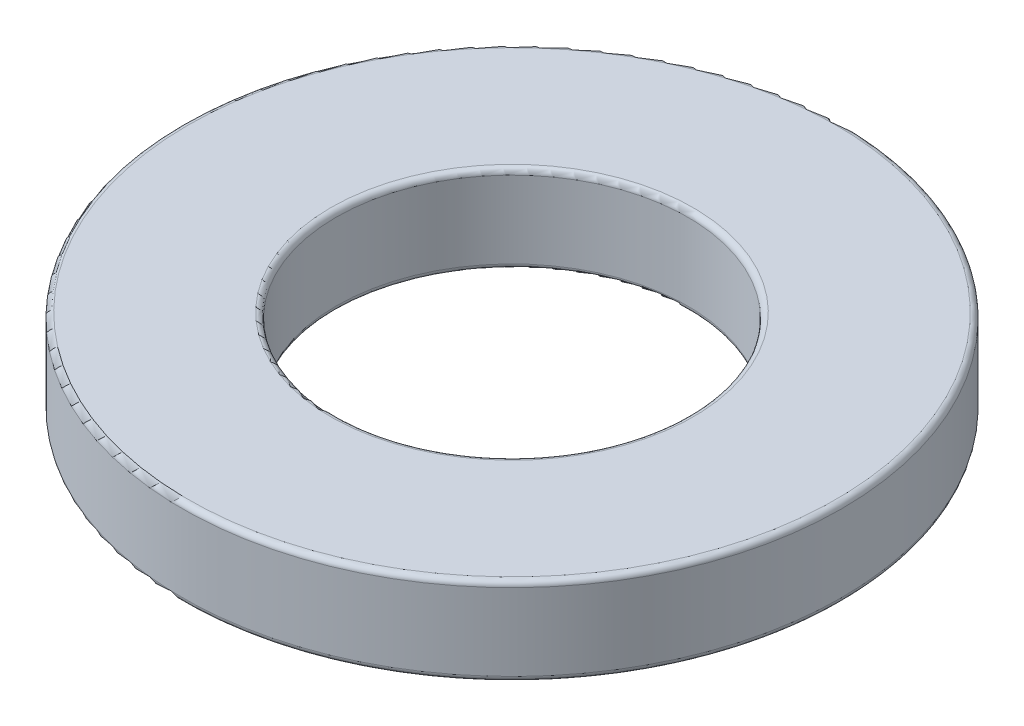
ISO-10303-21;
HEADER;
FILE_DESCRIPTION(('STEP AP214'),'2;1');
FILE_NAME('part.step','',(''),(''),'','','');
FILE_SCHEMA(('AUTOMOTIVE_DESIGN { 1 0 10303 214 1 1 1 1 }'));
ENDSEC;
DATA;
#1=APPLICATION_CONTEXT('core data for automotive mechanical design processes');
#2=APPLICATION_PROTOCOL_DEFINITION('international standard','automotive_design',2000,#1);
#3=PRODUCT_CONTEXT('',#1,'mechanical');
#4=PRODUCT('Part','Part','',(#3));
#5=PRODUCT_RELATED_PRODUCT_CATEGORY('part','',(#4));
#6=PRODUCT_DEFINITION_FORMATION('','',#4);
#7=PRODUCT_DEFINITION_CONTEXT('part definition',#1,'design');
#8=PRODUCT_DEFINITION('design','',#6,#7);
#9=PRODUCT_DEFINITION_SHAPE('','',#8);
#10=(LENGTH_UNIT() NAMED_UNIT(*) SI_UNIT(.MILLI.,.METRE.));
#11=(NAMED_UNIT(*) PLANE_ANGLE_UNIT() SI_UNIT($,.RADIAN.));
#12=(NAMED_UNIT(*) SI_UNIT($,.STERADIAN.) SOLID_ANGLE_UNIT());
#13=UNCERTAINTY_MEASURE_WITH_UNIT(LENGTH_MEASURE(1.E-05),#10,'distance_accuracy_value','');
#14=(GEOMETRIC_REPRESENTATION_CONTEXT(3) GLOBAL_UNCERTAINTY_ASSIGNED_CONTEXT((#13)) GLOBAL_UNIT_ASSIGNED_CONTEXT((#10,
#11,#12)) REPRESENTATION_CONTEXT('',''));
#15=CARTESIAN_POINT('',(0.,0.,0.));
#16=DIRECTION('',(0.,0.,1.));
#17=DIRECTION('',(1.,0.,0.));
#18=AXIS2_PLACEMENT_3D('',#15,#16,#17);
#19=CARTESIAN_POINT('',(0.,1.5,0.));
#20=DIRECTION('',(0.,-1.,0.));
#21=DIRECTION('',(0.,0.,-1.));
#22=AXIS2_PLACEMENT_3D('',#19,#20,#21);
#23=TOROIDAL_SURFACE('',#22,3.3,0.1);
#24=CARTESIAN_POINT('',(0.,1.6,0.));
#25=DIRECTION('',(0.,1.,0.));
#26=DIRECTION('',(1.,0.,0.));
#27=AXIS2_PLACEMENT_3D('',#24,#25,#26);
#28=CIRCLE('',#27,3.3);
#29=CARTESIAN_POINT('',(-3.3,1.6,0.));
#30=VERTEX_POINT('',#29);
#31=EDGE_CURVE('E80',#30,#30,#28,.T.);
#32=ORIENTED_EDGE('',*,*,#31,.T.);
#33=EDGE_LOOP('',(#32));
#34=FACE_BOUND('',#33,.T.);
#35=CARTESIAN_POINT('',(0.,1.5,0.));
#36=DIRECTION('',(0.,-1.,0.));
#37=DIRECTION('',(1.,0.,0.));
#38=AXIS2_PLACEMENT_3D('',#35,#36,#37);
#39=CIRCLE('',#38,3.2);
#40=CARTESIAN_POINT('',(-3.2,1.5,0.));
#41=VERTEX_POINT('',#40);
#42=EDGE_CURVE('E10',#41,#41,#39,.T.);
#43=ORIENTED_EDGE('',*,*,#42,.T.);
#44=EDGE_LOOP('',(#43));
#45=FACE_BOUND('',#44,.T.);
#46=ADVANCED_FACE('F16',(#34,#45),#23,.T.);
#47=CARTESIAN_POINT('',(0.,0.,0.));
#48=DIRECTION('',(0.,1.,0.));
#49=DIRECTION('',(1.,0.,0.));
#50=AXIS2_PLACEMENT_3D('',#47,#48,#49);
#51=CYLINDRICAL_SURFACE('',#50,3.2);
#52=CARTESIAN_POINT('',(0.,0.1,0.));
#53=DIRECTION('',(0.,1.,0.));
#54=DIRECTION('',(1.,0.,0.));
#55=AXIS2_PLACEMENT_3D('',#52,#53,#54);
#56=CIRCLE('',#55,3.2);
#57=CARTESIAN_POINT('',(-3.2,0.1,0.));
#58=VERTEX_POINT('',#57);
#59=EDGE_CURVE('E25',#58,#58,#56,.T.);
#60=ORIENTED_EDGE('',*,*,#59,.F.);
#61=EDGE_LOOP('',(#60));
#62=FACE_BOUND('',#61,.T.);
#63=ORIENTED_EDGE('',*,*,#42,.F.);
#64=EDGE_LOOP('',(#63));
#65=FACE_BOUND('',#64,.T.);
#66=ADVANCED_FACE('F18',(#62,#65),#51,.F.);
#67=CARTESIAN_POINT('',(0.,0.1,0.));
#68=DIRECTION('',(0.,1.,0.));
#69=DIRECTION('',(0.,0.,1.));
#70=AXIS2_PLACEMENT_3D('',#67,#68,#69);
#71=TOROIDAL_SURFACE('',#70,3.3,0.1);
#72=CARTESIAN_POINT('',(0.,0.,0.));
#73=DIRECTION('',(0.,-1.,0.));
#74=DIRECTION('',(1.,0.,0.));
#75=AXIS2_PLACEMENT_3D('',#72,#73,#74);
#76=CIRCLE('',#75,3.3);
#77=CARTESIAN_POINT('',(-3.3,0.,0.));
#78=VERTEX_POINT('',#77);
#79=EDGE_CURVE('E86',#78,#78,#76,.T.);
#80=ORIENTED_EDGE('',*,*,#79,.T.);
#81=EDGE_LOOP('',(#80));
#82=FACE_BOUND('',#81,.T.);
#83=ORIENTED_EDGE('',*,*,#59,.T.);
#84=EDGE_LOOP('',(#83));
#85=FACE_BOUND('',#84,.T.);
#86=ADVANCED_FACE('F140',(#82,#85),#71,.T.);
#87=CARTESIAN_POINT('',(0.,0.,0.));
#88=DIRECTION('',(0.,-1.,0.));
#89=DIRECTION('',(0.,0.,-1.));
#90=AXIS2_PLACEMENT_3D('',#87,#88,#89);
#91=PLANE('',#90);
#92=ORIENTED_EDGE('',*,*,#79,.F.);
#93=EDGE_LOOP('',(#92));
#94=FACE_BOUND('',#93,.T.);
#95=CARTESIAN_POINT('',(0.,0.,0.));
#96=DIRECTION('',(0.,1.,0.));
#97=DIRECTION('',(1.,0.,0.));
#98=AXIS2_PLACEMENT_3D('',#95,#96,#97);
#99=CIRCLE('',#98,5.9);
#100=CARTESIAN_POINT('',(-5.9,0.,0.));
#101=VERTEX_POINT('',#100);
#102=EDGE_CURVE('E83',#101,#101,#99,.T.);
#103=ORIENTED_EDGE('',*,*,#102,.F.);
#104=EDGE_LOOP('',(#103));
#105=FACE_BOUND('',#104,.T.);
#106=ADVANCED_FACE('F145',(#94,#105),#91,.T.);
#107=CARTESIAN_POINT('',(0.,0.1,0.));
#108=DIRECTION('',(0.,-1.,0.));
#109=DIRECTION('',(0.,0.,-1.));
#110=AXIS2_PLACEMENT_3D('',#107,#108,#109);
#111=TOROIDAL_SURFACE('',#110,5.9,0.1);
#112=ORIENTED_EDGE('',*,*,#102,.T.);
#113=EDGE_LOOP('',(#112));
#114=FACE_BOUND('',#113,.T.);
#115=CARTESIAN_POINT('',(0.,0.1,0.));
#116=DIRECTION('',(0.,-1.,0.));
#117=DIRECTION('',(1.,0.,0.));
#118=AXIS2_PLACEMENT_3D('',#115,#116,#117);
#119=CIRCLE('',#118,6.);
#120=CARTESIAN_POINT('',(-6.,0.1,0.));
#121=VERTEX_POINT('',#120);
#122=EDGE_CURVE('E76',#121,#121,#119,.T.);
#123=ORIENTED_EDGE('',*,*,#122,.T.);
#124=EDGE_LOOP('',(#123));
#125=FACE_BOUND('',#124,.T.);
#126=ADVANCED_FACE('F117',(#114,#125),#111,.T.);
#127=CARTESIAN_POINT('',(0.,1.6,0.));
#128=DIRECTION('',(0.,-1.,0.));
#129=DIRECTION('',(0.,0.,-1.));
#130=AXIS2_PLACEMENT_3D('',#127,#128,#129);
#131=PLANE('',#130);
#132=ORIENTED_EDGE('',*,*,#31,.F.);
#133=EDGE_LOOP('',(#132));
#134=FACE_BOUND('',#133,.T.);
#135=CARTESIAN_POINT('',(0.,1.6,0.));
#136=DIRECTION('',(0.,-1.,0.));
#137=DIRECTION('',(1.,0.,0.));
#138=AXIS2_PLACEMENT_3D('',#135,#136,#137);
#139=CIRCLE('',#138,5.9);
#140=CARTESIAN_POINT('',(-5.9,1.6,0.));
#141=VERTEX_POINT('',#140);
#142=EDGE_CURVE('E66',#141,#141,#139,.T.);
#143=ORIENTED_EDGE('',*,*,#142,.F.);
#144=EDGE_LOOP('',(#143));
#145=FACE_BOUND('',#144,.T.);
#146=ADVANCED_FACE('F121',(#134,#145),#131,.F.);
#147=CARTESIAN_POINT('',(0.,0.,0.));
#148=DIRECTION('',(0.,1.,0.));
#149=DIRECTION('',(1.,0.,0.));
#150=AXIS2_PLACEMENT_3D('',#147,#148,#149);
#151=CYLINDRICAL_SURFACE('',#150,6.);
#152=CARTESIAN_POINT('',(0.,1.5,0.));
#153=DIRECTION('',(0.,1.,0.));
#154=DIRECTION('',(1.,0.,0.));
#155=AXIS2_PLACEMENT_3D('',#152,#153,#154);
#156=CIRCLE('',#155,6.);
#157=CARTESIAN_POINT('',(-6.,1.5,0.));
#158=VERTEX_POINT('',#157);
#159=EDGE_CURVE('E70',#158,#158,#156,.T.);
#160=ORIENTED_EDGE('',*,*,#159,.F.);
#161=EDGE_LOOP('',(#160));
#162=FACE_BOUND('',#161,.T.);
#163=ORIENTED_EDGE('',*,*,#122,.F.);
#164=EDGE_LOOP('',(#163));
#165=FACE_BOUND('',#164,.T.);
#166=ADVANCED_FACE('F119',(#162,#165),#151,.T.);
#167=CARTESIAN_POINT('',(0.,1.5,0.));
#168=DIRECTION('',(0.,-1.,0.));
#169=DIRECTION('',(0.,0.,-1.));
#170=AXIS2_PLACEMENT_3D('',#167,#168,#169);
#171=TOROIDAL_SURFACE('',#170,5.9,0.1);
#172=ORIENTED_EDGE('',*,*,#159,.T.);
#173=EDGE_LOOP('',(#172));
#174=FACE_BOUND('',#173,.T.);
#175=ORIENTED_EDGE('',*,*,#142,.T.);
#176=EDGE_LOOP('',(#175));
#177=FACE_BOUND('',#176,.T.);
#178=ADVANCED_FACE('F67',(#174,#177),#171,.T.);
#179=CLOSED_SHELL('',(#46,#66,#86,#106,#126,#146,#166,#178));
#180=MANIFOLD_SOLID_BREP('B1',#179);
#181=ADVANCED_BREP_SHAPE_REPRESENTATION('',(#18,#180),#14);
#182=SHAPE_DEFINITION_REPRESENTATION(#9,#181);
ENDSEC;
END-ISO-10303-21;
